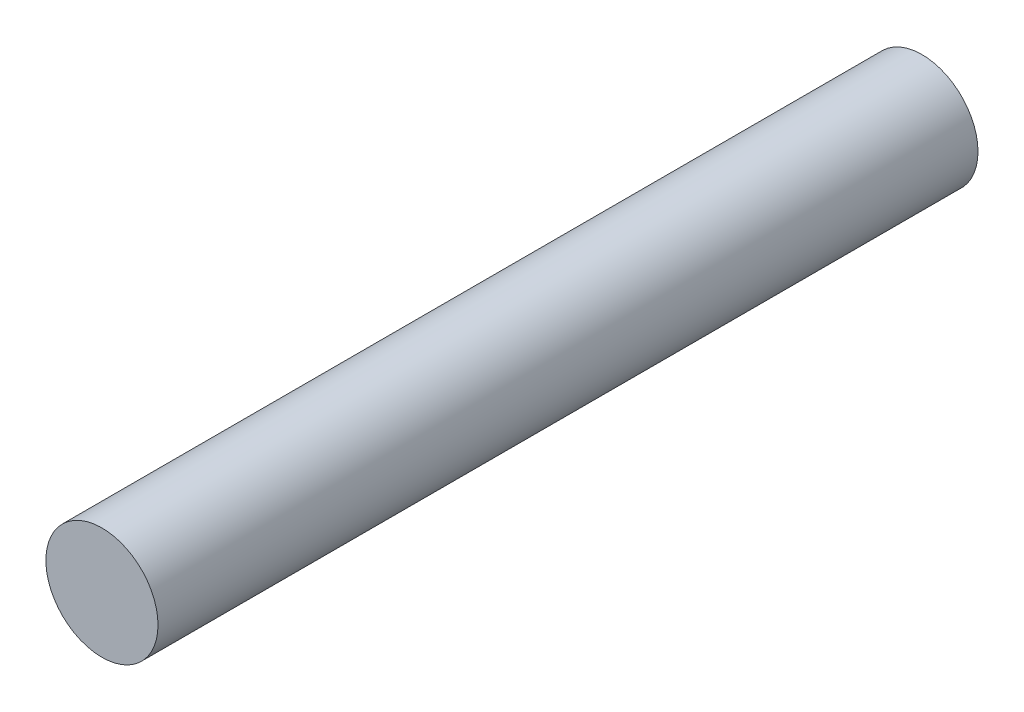
ISO-10303-21;
HEADER;
FILE_DESCRIPTION(('STEP AP214'),'2;1');
FILE_NAME('part.step','',(''),(''),'','','');
FILE_SCHEMA(('AUTOMOTIVE_DESIGN { 1 0 10303 214 1 1 1 1 }'));
ENDSEC;
DATA;
#1=APPLICATION_CONTEXT('core data for automotive mechanical design processes');
#2=APPLICATION_PROTOCOL_DEFINITION('international standard','automotive_design',2000,#1);
#3=PRODUCT_CONTEXT('',#1,'mechanical');
#4=PRODUCT('Part','Part','',(#3));
#5=PRODUCT_RELATED_PRODUCT_CATEGORY('part','',(#4));
#6=PRODUCT_DEFINITION_FORMATION('','',#4);
#7=PRODUCT_DEFINITION_CONTEXT('part definition',#1,'design');
#8=PRODUCT_DEFINITION('design','',#6,#7);
#9=PRODUCT_DEFINITION_SHAPE('','',#8);
#10=(LENGTH_UNIT() NAMED_UNIT(*) SI_UNIT(.MILLI.,.METRE.));
#11=(NAMED_UNIT(*) PLANE_ANGLE_UNIT() SI_UNIT($,.RADIAN.));
#12=(NAMED_UNIT(*) SI_UNIT($,.STERADIAN.) SOLID_ANGLE_UNIT());
#13=UNCERTAINTY_MEASURE_WITH_UNIT(LENGTH_MEASURE(1.E-05),#10,'distance_accuracy_value','');
#14=(GEOMETRIC_REPRESENTATION_CONTEXT(3) GLOBAL_UNCERTAINTY_ASSIGNED_CONTEXT((#13)) GLOBAL_UNIT_ASSIGNED_CONTEXT((#10,
#11,#12)) REPRESENTATION_CONTEXT('',''));
#15=CARTESIAN_POINT('',(0.,0.,0.));
#16=DIRECTION('',(0.,0.,1.));
#17=DIRECTION('',(1.,0.,0.));
#18=AXIS2_PLACEMENT_3D('',#15,#16,#17);
#19=CARTESIAN_POINT('',(0.,0.,17.4625));
#20=DIRECTION('',(0.,0.,-1.));
#21=DIRECTION('',(-1.,0.,0.));
#22=AXIS2_PLACEMENT_3D('',#19,#20,#21);
#23=CYLINDRICAL_SURFACE('',#22,2.3876);
#24=CARTESIAN_POINT('',(0.,0.,17.4625));
#25=DIRECTION('',(0.,0.,1.));
#26=DIRECTION('',(1.,0.,0.));
#27=AXIS2_PLACEMENT_3D('',#24,#25,#26);
#28=CIRCLE('',#27,2.3876);
#29=CARTESIAN_POINT('',(2.3876,0.,17.4625));
#30=VERTEX_POINT('',#29);
#31=EDGE_CURVE('E10',#30,#30,#28,.T.);
#32=ORIENTED_EDGE('',*,*,#31,.F.);
#33=EDGE_LOOP('',(#32));
#34=FACE_BOUND('',#33,.T.);
#35=CARTESIAN_POINT('',(0.,0.,-17.4625));
#36=DIRECTION('',(0.,0.,1.));
#37=DIRECTION('',(1.,0.,0.));
#38=AXIS2_PLACEMENT_3D('',#35,#36,#37);
#39=CIRCLE('',#38,2.3876);
#40=CARTESIAN_POINT('',(2.3876,0.,-17.4625));
#41=VERTEX_POINT('',#40);
#42=EDGE_CURVE('E33',#41,#41,#39,.T.);
#43=ORIENTED_EDGE('',*,*,#42,.T.);
#44=EDGE_LOOP('',(#43));
#45=FACE_BOUND('',#44,.T.);
#46=ADVANCED_FACE('F30',(#34,#45),#23,.T.);
#47=CARTESIAN_POINT('',(0.,0.,17.4625));
#48=DIRECTION('',(0.,0.,1.));
#49=DIRECTION('',(1.,0.,0.));
#50=AXIS2_PLACEMENT_3D('',#47,#48,#49);
#51=PLANE('',#50);
#52=ORIENTED_EDGE('',*,*,#31,.T.);
#53=EDGE_LOOP('',(#52));
#54=FACE_BOUND('',#53,.T.);
#55=ADVANCED_FACE('F45',(#54),#51,.T.);
#56=CARTESIAN_POINT('',(0.,0.,-17.4625));
#57=DIRECTION('',(0.,0.,1.));
#58=DIRECTION('',(1.,0.,0.));
#59=AXIS2_PLACEMENT_3D('',#56,#57,#58);
#60=PLANE('',#59);
#61=ORIENTED_EDGE('',*,*,#42,.F.);
#62=EDGE_LOOP('',(#61));
#63=FACE_BOUND('',#62,.T.);
#64=ADVANCED_FACE('F43',(#63),#60,.F.);
#65=CLOSED_SHELL('',(#46,#55,#64));
#66=MANIFOLD_SOLID_BREP('B2',#65);
#67=ADVANCED_BREP_SHAPE_REPRESENTATION('',(#18,#66),#14);
#68=SHAPE_DEFINITION_REPRESENTATION(#9,#67);
ENDSEC;
END-ISO-10303-21;
